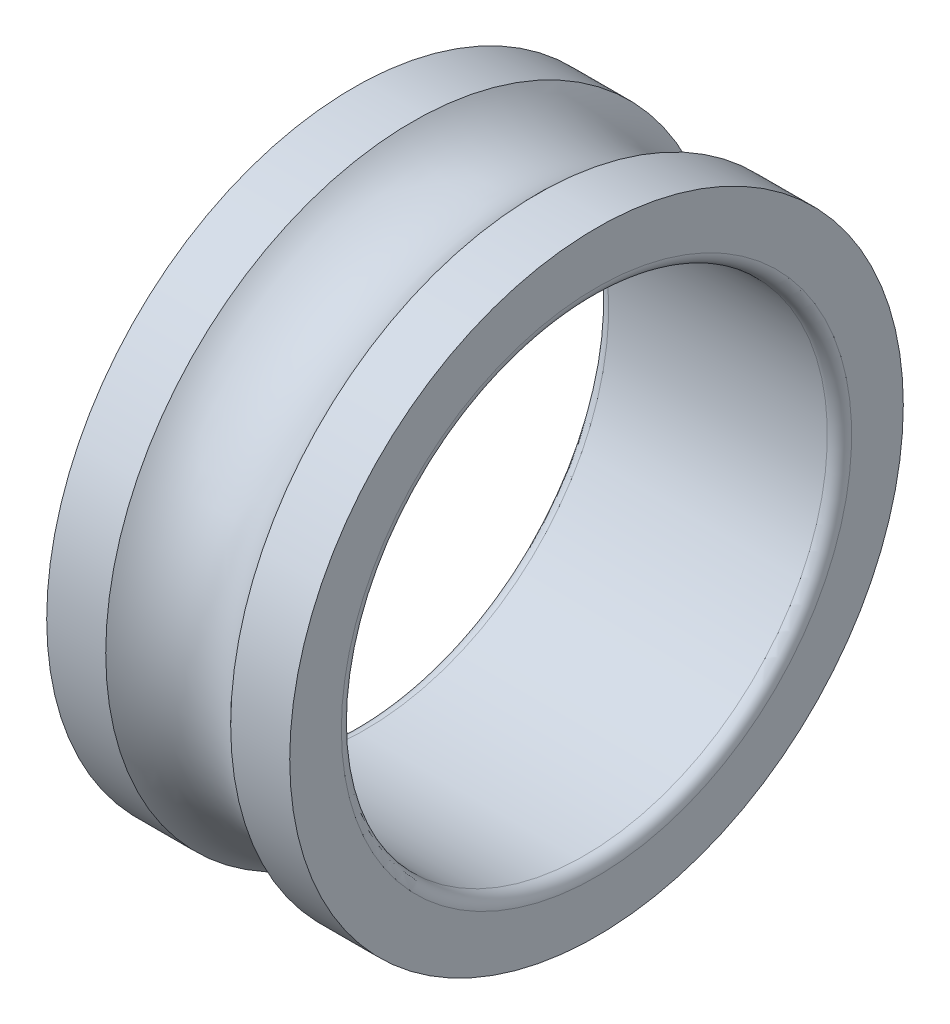
ISO-10303-21;
HEADER;
FILE_DESCRIPTION(('STEP AP214'),'2;1');
FILE_NAME('part.step','',(''),(''),'','','');
FILE_SCHEMA(('AUTOMOTIVE_DESIGN { 1 0 10303 214 1 1 1 1 }'));
ENDSEC;
DATA;
#1=APPLICATION_CONTEXT('core data for automotive mechanical design processes');
#2=APPLICATION_PROTOCOL_DEFINITION('international standard','automotive_design',2000,#1);
#3=PRODUCT_CONTEXT('',#1,'mechanical');
#4=PRODUCT('Part','Part','',(#3));
#5=PRODUCT_RELATED_PRODUCT_CATEGORY('part','',(#4));
#6=PRODUCT_DEFINITION_FORMATION('','',#4);
#7=PRODUCT_DEFINITION_CONTEXT('part definition',#1,'design');
#8=PRODUCT_DEFINITION('design','',#6,#7);
#9=PRODUCT_DEFINITION_SHAPE('','',#8);
#10=(LENGTH_UNIT() NAMED_UNIT(*) SI_UNIT(.MILLI.,.METRE.));
#11=(NAMED_UNIT(*) PLANE_ANGLE_UNIT() SI_UNIT($,.RADIAN.));
#12=(NAMED_UNIT(*) SI_UNIT($,.STERADIAN.) SOLID_ANGLE_UNIT());
#13=UNCERTAINTY_MEASURE_WITH_UNIT(LENGTH_MEASURE(1.E-05),#10,'distance_accuracy_value','');
#14=(GEOMETRIC_REPRESENTATION_CONTEXT(3) GLOBAL_UNCERTAINTY_ASSIGNED_CONTEXT((#13)) GLOBAL_UNIT_ASSIGNED_CONTEXT((#10,
#11,#12)) REPRESENTATION_CONTEXT('',''));
#15=CARTESIAN_POINT('',(0.,0.,0.));
#16=DIRECTION('',(0.,0.,1.));
#17=DIRECTION('',(1.,0.,0.));
#18=AXIS2_PLACEMENT_3D('',#15,#16,#17);
#19=CARTESIAN_POINT('',(0.2,0.,0.));
#20=DIRECTION('',(-1.,0.,0.));
#21=DIRECTION('',(0.,0.,1.));
#22=AXIS2_PLACEMENT_3D('',#19,#20,#21);
#23=TOROIDAL_SURFACE('',#22,4.2,0.2);
#24=CARTESIAN_POINT('',(0.2,0.,0.));
#25=DIRECTION('',(-1.,0.,0.));
#26=DIRECTION('',(0.,0.,1.));
#27=AXIS2_PLACEMENT_3D('',#24,#25,#26);
#28=CIRCLE('',#27,4.);
#29=CARTESIAN_POINT('',(0.2,0.,4.));
#30=VERTEX_POINT('',#29);
#31=EDGE_CURVE('E10',#30,#30,#28,.T.);
#32=ORIENTED_EDGE('',*,*,#31,.F.);
#33=EDGE_LOOP('',(#32));
#34=FACE_BOUND('',#33,.T.);
#35=CARTESIAN_POINT('',(0.,0.,0.));
#36=DIRECTION('',(-1.,0.,0.));
#37=DIRECTION('',(0.,0.,1.));
#38=AXIS2_PLACEMENT_3D('',#35,#36,#37);
#39=CIRCLE('',#38,4.2);
#40=CARTESIAN_POINT('',(0.,0.,4.2));
#41=VERTEX_POINT('',#40);
#42=EDGE_CURVE('E57',#41,#41,#39,.T.);
#43=ORIENTED_EDGE('',*,*,#42,.T.);
#44=EDGE_LOOP('',(#43));
#45=FACE_BOUND('',#44,.T.);
#46=ADVANCED_FACE('F29',(#34,#45),#23,.T.);
#47=CARTESIAN_POINT('',(0.,0.,0.));
#48=DIRECTION('',(-1.,0.,0.));
#49=DIRECTION('',(0.,0.,1.));
#50=AXIS2_PLACEMENT_3D('',#47,#48,#49);
#51=CYLINDRICAL_SURFACE('',#50,4.);
#52=ORIENTED_EDGE('',*,*,#31,.T.);
#53=EDGE_LOOP('',(#52));
#54=FACE_BOUND('',#53,.T.);
#55=CARTESIAN_POINT('',(3.8,0.,0.));
#56=DIRECTION('',(-1.,0.,0.));
#57=DIRECTION('',(0.,0.,1.));
#58=AXIS2_PLACEMENT_3D('',#55,#56,#57);
#59=CIRCLE('',#58,4.);
#60=CARTESIAN_POINT('',(3.8,0.,4.));
#61=VERTEX_POINT('',#60);
#62=EDGE_CURVE('E35',#61,#61,#59,.T.);
#63=ORIENTED_EDGE('',*,*,#62,.F.);
#64=EDGE_LOOP('',(#63));
#65=FACE_BOUND('',#64,.T.);
#66=ADVANCED_FACE('F80',(#54,#65),#51,.F.);
#67=CARTESIAN_POINT('',(3.8,0.,0.));
#68=DIRECTION('',(-1.,0.,0.));
#69=DIRECTION('',(0.,0.,1.));
#70=AXIS2_PLACEMENT_3D('',#67,#68,#69);
#71=TOROIDAL_SURFACE('',#70,4.2,0.199999999999999);
#72=CARTESIAN_POINT('',(4.,0.,0.));
#73=DIRECTION('',(-1.,0.,0.));
#74=DIRECTION('',(0.,0.,1.));
#75=AXIS2_PLACEMENT_3D('',#72,#73,#74);
#76=CIRCLE('',#75,4.2);
#77=CARTESIAN_POINT('',(4.,0.,4.2));
#78=VERTEX_POINT('',#77);
#79=EDGE_CURVE('E39',#78,#78,#76,.T.);
#80=ORIENTED_EDGE('',*,*,#79,.F.);
#81=EDGE_LOOP('',(#80));
#82=FACE_BOUND('',#81,.T.);
#83=ORIENTED_EDGE('',*,*,#62,.T.);
#84=EDGE_LOOP('',(#83));
#85=FACE_BOUND('',#84,.T.);
#86=ADVANCED_FACE('F85',(#82,#85),#71,.T.);
#87=CARTESIAN_POINT('',(4.,4.2,0.));
#88=DIRECTION('',(-1.,0.,0.));
#89=DIRECTION('',(0.,0.,1.));
#90=AXIS2_PLACEMENT_3D('',#87,#88,#89);
#91=PLANE('',#90);
#92=CARTESIAN_POINT('',(4.,0.,0.));
#93=DIRECTION('',(-1.,0.,0.));
#94=DIRECTION('',(0.,0.,1.));
#95=AXIS2_PLACEMENT_3D('',#92,#93,#94);
#96=CIRCLE('',#95,5.05);
#97=CARTESIAN_POINT('',(4.,0.,5.05));
#98=VERTEX_POINT('',#97);
#99=EDGE_CURVE('E43',#98,#98,#96,.T.);
#100=ORIENTED_EDGE('',*,*,#99,.F.);
#101=EDGE_LOOP('',(#100));
#102=FACE_BOUND('',#101,.T.);
#103=ORIENTED_EDGE('',*,*,#79,.T.);
#104=EDGE_LOOP('',(#103));
#105=FACE_BOUND('',#104,.T.);
#106=ADVANCED_FACE('F89',(#102,#105),#91,.F.);
#107=CARTESIAN_POINT('',(0.,0.,0.));
#108=DIRECTION('',(-1.,0.,0.));
#109=DIRECTION('',(0.,0.,1.));
#110=AXIS2_PLACEMENT_3D('',#107,#108,#109);
#111=CYLINDRICAL_SURFACE('',#110,5.05);
#112=ORIENTED_EDGE('',*,*,#99,.T.);
#113=EDGE_LOOP('',(#112));
#114=FACE_BOUND('',#113,.T.);
#115=CARTESIAN_POINT('',(3.02834819006016,0.,0.));
#116=DIRECTION('',(-1.,0.,0.));
#117=DIRECTION('',(0.,0.,1.));
#118=AXIS2_PLACEMENT_3D('',#115,#116,#117);
#119=CIRCLE('',#118,5.05);
#120=CARTESIAN_POINT('',(3.02834819006016,0.,5.05));
#121=VERTEX_POINT('',#120);
#122=EDGE_CURVE('E48',#121,#121,#119,.T.);
#123=ORIENTED_EDGE('',*,*,#122,.F.);
#124=EDGE_LOOP('',(#123));
#125=FACE_BOUND('',#124,.T.);
#126=ADVANCED_FACE('F76',(#114,#125),#111,.T.);
#127=CARTESIAN_POINT('',(2.,0.,0.));
#128=DIRECTION('',(-1.,0.,0.));
#129=DIRECTION('',(0.,0.,1.));
#130=AXIS2_PLACEMENT_3D('',#127,#128,#129);
#131=TOROIDAL_SURFACE('',#130,6.,1.4);
#132=ORIENTED_EDGE('',*,*,#122,.T.);
#133=EDGE_LOOP('',(#132));
#134=FACE_BOUND('',#133,.T.);
#135=CARTESIAN_POINT('',(0.971651809939845,0.,0.));
#136=DIRECTION('',(-1.,0.,0.));
#137=DIRECTION('',(0.,0.,1.));
#138=AXIS2_PLACEMENT_3D('',#135,#136,#137);
#139=CIRCLE('',#138,5.05);
#140=CARTESIAN_POINT('',(0.971651809939845,0.,5.05));
#141=VERTEX_POINT('',#140);
#142=EDGE_CURVE('E51',#141,#141,#139,.T.);
#143=ORIENTED_EDGE('',*,*,#142,.F.);
#144=EDGE_LOOP('',(#143));
#145=FACE_BOUND('',#144,.T.);
#146=ADVANCED_FACE('F70',(#134,#145),#131,.F.);
#147=CARTESIAN_POINT('',(0.,0.,0.));
#148=DIRECTION('',(-1.,0.,0.));
#149=DIRECTION('',(0.,0.,1.));
#150=AXIS2_PLACEMENT_3D('',#147,#148,#149);
#151=CYLINDRICAL_SURFACE('',#150,5.05);
#152=ORIENTED_EDGE('',*,*,#142,.T.);
#153=EDGE_LOOP('',(#152));
#154=FACE_BOUND('',#153,.T.);
#155=CARTESIAN_POINT('',(0.,0.,0.));
#156=DIRECTION('',(-1.,0.,0.));
#157=DIRECTION('',(0.,0.,1.));
#158=AXIS2_PLACEMENT_3D('',#155,#156,#157);
#159=CIRCLE('',#158,5.05);
#160=CARTESIAN_POINT('',(0.,0.,5.05));
#161=VERTEX_POINT('',#160);
#162=EDGE_CURVE('E54',#161,#161,#159,.T.);
#163=ORIENTED_EDGE('',*,*,#162,.F.);
#164=EDGE_LOOP('',(#163));
#165=FACE_BOUND('',#164,.T.);
#166=ADVANCED_FACE('F65',(#154,#165),#151,.T.);
#167=CARTESIAN_POINT('',(0.,5.05,0.));
#168=DIRECTION('',(1.,0.,0.));
#169=DIRECTION('',(0.,0.,-1.));
#170=AXIS2_PLACEMENT_3D('',#167,#168,#169);
#171=PLANE('',#170);
#172=ORIENTED_EDGE('',*,*,#42,.F.);
#173=EDGE_LOOP('',(#172));
#174=FACE_BOUND('',#173,.T.);
#175=ORIENTED_EDGE('',*,*,#162,.T.);
#176=EDGE_LOOP('',(#175));
#177=FACE_BOUND('',#176,.T.);
#178=ADVANCED_FACE('F62',(#174,#177),#171,.F.);
#179=CLOSED_SHELL('',(#46,#66,#86,#106,#126,#146,#166,#178));
#180=MANIFOLD_SOLID_BREP('B2',#179);
#181=ADVANCED_BREP_SHAPE_REPRESENTATION('',(#18,#180),#14);
#182=SHAPE_DEFINITION_REPRESENTATION(#9,#181);
ENDSEC;
END-ISO-10303-21;
